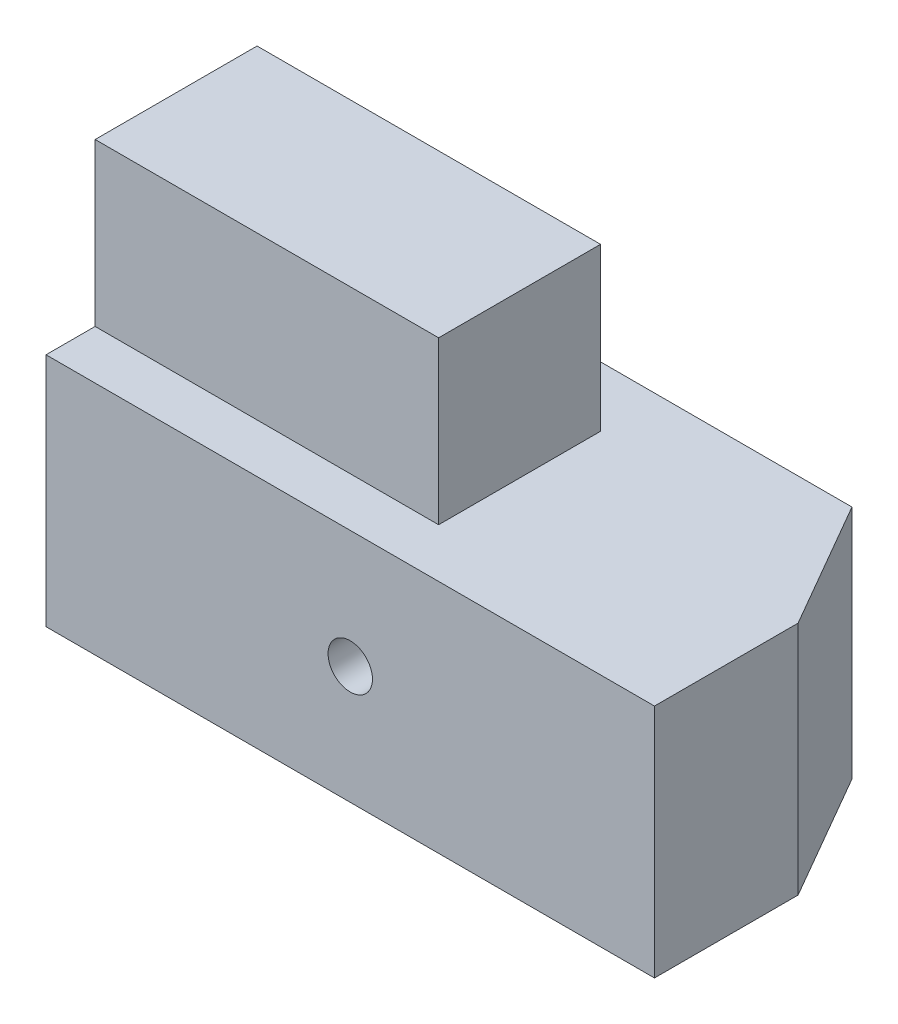
ISO-10303-21;
HEADER;
FILE_DESCRIPTION(('STEP AP214'),'2;1');
FILE_NAME('part.step','',(''),(''),'','','');
FILE_SCHEMA(('AUTOMOTIVE_DESIGN { 1 0 10303 214 1 1 1 1 }'));
ENDSEC;
DATA;
#1=APPLICATION_CONTEXT('core data for automotive mechanical design processes');
#2=APPLICATION_PROTOCOL_DEFINITION('international standard','automotive_design',2000,#1);
#3=PRODUCT_CONTEXT('',#1,'mechanical');
#4=PRODUCT('Part','Part','',(#3));
#5=PRODUCT_RELATED_PRODUCT_CATEGORY('part','',(#4));
#6=PRODUCT_DEFINITION_FORMATION('','',#4);
#7=PRODUCT_DEFINITION_CONTEXT('part definition',#1,'design');
#8=PRODUCT_DEFINITION('design','',#6,#7);
#9=PRODUCT_DEFINITION_SHAPE('','',#8);
#10=(LENGTH_UNIT() NAMED_UNIT(*) SI_UNIT(.MILLI.,.METRE.));
#11=(NAMED_UNIT(*) PLANE_ANGLE_UNIT() SI_UNIT($,.RADIAN.));
#12=(NAMED_UNIT(*) SI_UNIT($,.STERADIAN.) SOLID_ANGLE_UNIT());
#13=UNCERTAINTY_MEASURE_WITH_UNIT(LENGTH_MEASURE(1.E-05),#10,'distance_accuracy_value','');
#14=(GEOMETRIC_REPRESENTATION_CONTEXT(3) GLOBAL_UNCERTAINTY_ASSIGNED_CONTEXT((#13)) GLOBAL_UNIT_ASSIGNED_CONTEXT((#10,
#11,#12)) REPRESENTATION_CONTEXT('',''));
#15=CARTESIAN_POINT('',(0.,0.,0.));
#16=DIRECTION('',(0.,0.,1.));
#17=DIRECTION('',(1.,0.,0.));
#18=AXIS2_PLACEMENT_3D('',#15,#16,#17);
#19=CARTESIAN_POINT('',(-62.,24.,-55.25));
#20=DIRECTION('',(0.,1.,0.));
#21=DIRECTION('',(0.,0.,1.));
#22=AXIS2_PLACEMENT_3D('',#19,#20,#21);
#23=PLANE('',#22);
#24=DIRECTION('',(0.,0.,1.));
#25=VECTOR('',#24,1.);
#26=CARTESIAN_POINT('',(62.,24.,-55.25));
#27=LINE('',#26,#25);
#28=CARTESIAN_POINT('',(62.,24.,-29.2692378864669));
#29=VERTEX_POINT('',#28);
#30=CARTESIAN_POINT('',(62.,24.,0.));
#31=VERTEX_POINT('',#30);
#32=EDGE_CURVE('E164',#29,#31,#27,.T.);
#33=ORIENTED_EDGE('',*,*,#32,.F.);
#34=DIRECTION('',(-0.500000000000002,0.,-0.866025403784438));
#35=VECTOR('',#34,1.);
#36=CARTESIAN_POINT('',(19.7499999999998,24.,-102.448384506252));
#37=LINE('',#36,#35);
#38=CARTESIAN_POINT('',(47.,24.,-55.25));
#39=VERTEX_POINT('',#38);
#40=EDGE_CURVE('E57',#29,#39,#37,.T.);
#41=ORIENTED_EDGE('',*,*,#40,.T.);
#42=DIRECTION('',(-1.,0.,0.));
#43=VECTOR('',#42,1.);
#44=CARTESIAN_POINT('',(-62.,24.,-55.25));
#45=LINE('',#44,#43);
#46=CARTESIAN_POINT('',(-62.,24.,-55.25));
#47=VERTEX_POINT('',#46);
#48=EDGE_CURVE('E148',#39,#47,#45,.T.);
#49=ORIENTED_EDGE('',*,*,#48,.T.);
#50=DIRECTION('',(0.,0.,1.));
#51=VECTOR('',#50,1.);
#52=CARTESIAN_POINT('',(-62.,24.,-55.25));
#53=LINE('',#52,#51);
#54=CARTESIAN_POINT('',(-62.,24.,0.));
#55=VERTEX_POINT('',#54);
#56=EDGE_CURVE('E161',#47,#55,#53,.T.);
#57=ORIENTED_EDGE('',*,*,#56,.T.);
#58=DIRECTION('',(-1.,0.,0.));
#59=VECTOR('',#58,1.);
#60=CARTESIAN_POINT('',(-62.,24.,0.));
#61=LINE('',#60,#59);
#62=EDGE_CURVE('E146',#31,#55,#61,.T.);
#63=ORIENTED_EDGE('',*,*,#62,.F.);
#64=EDGE_LOOP('',(#33,#41,#49,#57,#63));
#65=FACE_BOUND('',#64,.T.);
#66=DIRECTION('',(1.,0.,0.));
#67=VECTOR('',#66,1.);
#68=CARTESIAN_POINT('',(-61.99,24.,-10.));
#69=LINE('',#68,#67);
#70=CARTESIAN_POINT('',(-61.99,24.,-10.));
#71=VERTEX_POINT('',#70);
#72=CARTESIAN_POINT('',(8.01000000000002,24.,-10.));
#73=VERTEX_POINT('',#72);
#74=EDGE_CURVE('E240',#71,#73,#69,.T.);
#75=ORIENTED_EDGE('',*,*,#74,.F.);
#76=DIRECTION('',(0.,0.,1.));
#77=VECTOR('',#76,1.);
#78=CARTESIAN_POINT('',(-61.99,24.,-43.));
#79=LINE('',#78,#77);
#80=CARTESIAN_POINT('',(-61.99,24.,-43.));
#81=VERTEX_POINT('',#80);
#82=EDGE_CURVE('E128',#81,#71,#79,.T.);
#83=ORIENTED_EDGE('',*,*,#82,.F.);
#84=DIRECTION('',(-1.,0.,0.));
#85=VECTOR('',#84,1.);
#86=CARTESIAN_POINT('',(-61.99,24.,-43.));
#87=LINE('',#86,#85);
#88=CARTESIAN_POINT('',(8.01000000000001,24.,-43.));
#89=VERTEX_POINT('',#88);
#90=EDGE_CURVE('E124',#89,#81,#87,.T.);
#91=ORIENTED_EDGE('',*,*,#90,.F.);
#92=DIRECTION('',(0.,0.,-1.));
#93=VECTOR('',#92,1.);
#94=CARTESIAN_POINT('',(8.01000000000002,24.,-43.));
#95=LINE('',#94,#93);
#96=EDGE_CURVE('E237',#73,#89,#95,.T.);
#97=ORIENTED_EDGE('',*,*,#96,.F.);
#98=EDGE_LOOP('',(#75,#83,#91,#97));
#99=FACE_BOUND('',#98,.T.);
#100=ADVANCED_FACE('F35',(#65,#99),#23,.T.);
#101=CARTESIAN_POINT('',(-62.,24.,-55.25));
#102=DIRECTION('',(-1.,0.,0.));
#103=DIRECTION('',(0.,0.,1.));
#104=AXIS2_PLACEMENT_3D('',#101,#102,#103);
#105=PLANE('',#104);
#106=DIRECTION('',(0.,-1.,0.));
#107=VECTOR('',#106,1.);
#108=CARTESIAN_POINT('',(-62.,24.,0.));
#109=LINE('',#108,#107);
#110=CARTESIAN_POINT('',(-62.,-24.,0.));
#111=VERTEX_POINT('',#110);
#112=EDGE_CURVE('E140',#55,#111,#109,.T.);
#113=ORIENTED_EDGE('',*,*,#112,.F.);
#114=ORIENTED_EDGE('',*,*,#56,.F.);
#115=DIRECTION('',(0.,-1.,0.));
#116=VECTOR('',#115,1.);
#117=CARTESIAN_POINT('',(-62.,24.,-55.25));
#118=LINE('',#117,#116);
#119=CARTESIAN_POINT('',(-62.,-24.,-55.25));
#120=VERTEX_POINT('',#119);
#121=EDGE_CURVE('E142',#47,#120,#118,.T.);
#122=ORIENTED_EDGE('',*,*,#121,.T.);
#123=DIRECTION('',(0.,0.,1.));
#124=VECTOR('',#123,1.);
#125=CARTESIAN_POINT('',(-62.,-24.,-55.25));
#126=LINE('',#125,#124);
#127=EDGE_CURVE('E150',#120,#111,#126,.T.);
#128=ORIENTED_EDGE('',*,*,#127,.T.);
#129=EDGE_LOOP('',(#113,#114,#122,#128));
#130=FACE_BOUND('',#129,.T.);
#131=ADVANCED_FACE('F194',(#130),#105,.T.);
#132=CARTESIAN_POINT('',(62.,24.,-55.25));
#133=DIRECTION('',(1.,0.,0.));
#134=DIRECTION('',(0.,0.,-1.));
#135=AXIS2_PLACEMENT_3D('',#132,#133,#134);
#136=PLANE('',#135);
#137=DIRECTION('',(0.,0.,1.));
#138=VECTOR('',#137,1.);
#139=CARTESIAN_POINT('',(62.,-24.,-55.25));
#140=LINE('',#139,#138);
#141=CARTESIAN_POINT('',(62.,-24.,-29.2692378864669));
#142=VERTEX_POINT('',#141);
#143=CARTESIAN_POINT('',(62.,-24.,0.));
#144=VERTEX_POINT('',#143);
#145=EDGE_CURVE('E166',#142,#144,#140,.T.);
#146=ORIENTED_EDGE('',*,*,#145,.F.);
#147=DIRECTION('',(0.,1.,0.));
#148=VECTOR('',#147,1.);
#149=CARTESIAN_POINT('',(62.,24.,-29.2692378864669));
#150=LINE('',#149,#148);
#151=EDGE_CURVE('E163',#142,#29,#150,.T.);
#152=ORIENTED_EDGE('',*,*,#151,.T.);
#153=ORIENTED_EDGE('',*,*,#32,.T.);
#154=DIRECTION('',(0.,1.,0.));
#155=VECTOR('',#154,1.);
#156=CARTESIAN_POINT('',(62.,24.,0.));
#157=LINE('',#156,#155);
#158=EDGE_CURVE('E156',#144,#31,#157,.T.);
#159=ORIENTED_EDGE('',*,*,#158,.F.);
#160=EDGE_LOOP('',(#146,#152,#153,#159));
#161=FACE_BOUND('',#160,.T.);
#162=ADVANCED_FACE('F174',(#161),#136,.T.);
#163=CARTESIAN_POINT('',(-62.,-24.,-55.25));
#164=DIRECTION('',(0.,-1.,0.));
#165=DIRECTION('',(0.,0.,-1.));
#166=AXIS2_PLACEMENT_3D('',#163,#164,#165);
#167=PLANE('',#166);
#168=DIRECTION('',(1.,0.,0.));
#169=VECTOR('',#168,1.);
#170=CARTESIAN_POINT('',(-62.,-24.,-55.25));
#171=LINE('',#170,#169);
#172=CARTESIAN_POINT('',(47.,-24.,-55.25));
#173=VERTEX_POINT('',#172);
#174=EDGE_CURVE('E145',#120,#173,#171,.T.);
#175=ORIENTED_EDGE('',*,*,#174,.T.);
#176=DIRECTION('',(0.500000000000002,0.,0.866025403784438));
#177=VECTOR('',#176,1.);
#178=CARTESIAN_POINT('',(19.7499999999998,-24.,-102.448384506252));
#179=LINE('',#178,#177);
#180=EDGE_CURVE('E11',#173,#142,#179,.T.);
#181=ORIENTED_EDGE('',*,*,#180,.T.);
#182=ORIENTED_EDGE('',*,*,#145,.T.);
#183=DIRECTION('',(1.,0.,0.));
#184=VECTOR('',#183,1.);
#185=CARTESIAN_POINT('',(-62.,-24.,0.));
#186=LINE('',#185,#184);
#187=EDGE_CURVE('E153',#111,#144,#186,.T.);
#188=ORIENTED_EDGE('',*,*,#187,.F.);
#189=ORIENTED_EDGE('',*,*,#127,.F.);
#190=EDGE_LOOP('',(#175,#181,#182,#188,#189));
#191=FACE_BOUND('',#190,.T.);
#192=ADVANCED_FACE('F186',(#191),#167,.T.);
#193=CARTESIAN_POINT('',(0.,0.,-55.25));
#194=DIRECTION('',(0.,0.,1.));
#195=DIRECTION('',(1.,0.,0.));
#196=AXIS2_PLACEMENT_3D('',#193,#194,#195);
#197=PLANE('',#196);
#198=CARTESIAN_POINT('',(0.,0.,-55.25));
#199=DIRECTION('',(0.,0.,1.));
#200=DIRECTION('',(1.,0.,0.));
#201=AXIS2_PLACEMENT_3D('',#198,#199,#200);
#202=CIRCLE('',#201,4.525);
#203=CARTESIAN_POINT('',(4.525,0.,-55.25));
#204=VERTEX_POINT('',#203);
#205=EDGE_CURVE('E133',#204,#204,#202,.T.);
#206=ORIENTED_EDGE('',*,*,#205,.T.);
#207=EDGE_LOOP('',(#206));
#208=FACE_BOUND('',#207,.T.);
#209=ORIENTED_EDGE('',*,*,#48,.F.);
#210=DIRECTION('',(0.,-1.,0.));
#211=VECTOR('',#210,1.);
#212=CARTESIAN_POINT('',(47.,-24.,-55.25));
#213=LINE('',#212,#211);
#214=EDGE_CURVE('E43',#39,#173,#213,.T.);
#215=ORIENTED_EDGE('',*,*,#214,.T.);
#216=ORIENTED_EDGE('',*,*,#174,.F.);
#217=ORIENTED_EDGE('',*,*,#121,.F.);
#218=EDGE_LOOP('',(#209,#215,#216,#217));
#219=FACE_BOUND('',#218,.T.);
#220=ADVANCED_FACE('F206',(#208,#219),#197,.F.);
#221=CARTESIAN_POINT('',(0.,0.,0.));
#222=DIRECTION('',(0.,0.,1.));
#223=DIRECTION('',(1.,0.,0.));
#224=AXIS2_PLACEMENT_3D('',#221,#222,#223);
#225=PLANE('',#224);
#226=CARTESIAN_POINT('',(0.,0.,0.));
#227=DIRECTION('',(0.,0.,1.));
#228=DIRECTION('',(1.,0.,0.));
#229=AXIS2_PLACEMENT_3D('',#226,#227,#228);
#230=CIRCLE('',#229,4.525);
#231=CARTESIAN_POINT('',(4.525,0.,0.));
#232=VERTEX_POINT('',#231);
#233=EDGE_CURVE('E130',#232,#232,#230,.T.);
#234=ORIENTED_EDGE('',*,*,#233,.F.);
#235=EDGE_LOOP('',(#234));
#236=FACE_BOUND('',#235,.T.);
#237=ORIENTED_EDGE('',*,*,#112,.T.);
#238=ORIENTED_EDGE('',*,*,#187,.T.);
#239=ORIENTED_EDGE('',*,*,#158,.T.);
#240=ORIENTED_EDGE('',*,*,#62,.T.);
#241=EDGE_LOOP('',(#237,#238,#239,#240));
#242=FACE_BOUND('',#241,.T.);
#243=ADVANCED_FACE('F183',(#236,#242),#225,.T.);
#244=CARTESIAN_POINT('',(0.,0.,-55.25));
#245=DIRECTION('',(0.,0.,1.));
#246=DIRECTION('',(1.,0.,0.));
#247=AXIS2_PLACEMENT_3D('',#244,#245,#246);
#248=CYLINDRICAL_SURFACE('',#247,4.525);
#249=ORIENTED_EDGE('',*,*,#205,.F.);
#250=EDGE_LOOP('',(#249));
#251=FACE_BOUND('',#250,.T.);
#252=ORIENTED_EDGE('',*,*,#233,.T.);
#253=EDGE_LOOP('',(#252));
#254=FACE_BOUND('',#253,.T.);
#255=ADVANCED_FACE('F214',(#251,#254),#248,.F.);
#256=CARTESIAN_POINT('',(-61.99,57.,-43.));
#257=DIRECTION('',(1.,0.,0.));
#258=DIRECTION('',(0.,0.,-1.));
#259=AXIS2_PLACEMENT_3D('',#256,#257,#258);
#260=PLANE('',#259);
#261=ORIENTED_EDGE('',*,*,#82,.T.);
#262=DIRECTION('',(0.,-1.,0.));
#263=VECTOR('',#262,1.);
#264=CARTESIAN_POINT('',(-61.99,57.,-10.));
#265=LINE('',#264,#263);
#266=CARTESIAN_POINT('',(-61.99,57.,-10.));
#267=VERTEX_POINT('',#266);
#268=EDGE_CURVE('E108',#267,#71,#265,.T.);
#269=ORIENTED_EDGE('',*,*,#268,.F.);
#270=DIRECTION('',(0.,0.,1.));
#271=VECTOR('',#270,1.);
#272=CARTESIAN_POINT('',(-61.99,57.,-43.));
#273=LINE('',#272,#271);
#274=CARTESIAN_POINT('',(-61.99,57.,-43.));
#275=VERTEX_POINT('',#274);
#276=EDGE_CURVE('E115',#275,#267,#273,.T.);
#277=ORIENTED_EDGE('',*,*,#276,.F.);
#278=DIRECTION('',(0.,-1.,0.));
#279=VECTOR('',#278,1.);
#280=CARTESIAN_POINT('',(-61.99,57.,-43.));
#281=LINE('',#280,#279);
#282=EDGE_CURVE('E233',#275,#81,#281,.T.);
#283=ORIENTED_EDGE('',*,*,#282,.T.);
#284=EDGE_LOOP('',(#261,#269,#277,#283));
#285=FACE_BOUND('',#284,.T.);
#286=ADVANCED_FACE('F126',(#285),#260,.F.);
#287=CARTESIAN_POINT('',(-61.99,57.,-10.));
#288=DIRECTION('',(0.,0.,-1.));
#289=DIRECTION('',(-1.,0.,0.));
#290=AXIS2_PLACEMENT_3D('',#287,#288,#289);
#291=PLANE('',#290);
#292=ORIENTED_EDGE('',*,*,#74,.T.);
#293=DIRECTION('',(0.,-1.,0.));
#294=VECTOR('',#293,1.);
#295=CARTESIAN_POINT('',(8.01000000000002,57.,-10.));
#296=LINE('',#295,#294);
#297=CARTESIAN_POINT('',(8.01000000000002,57.,-10.));
#298=VERTEX_POINT('',#297);
#299=EDGE_CURVE('E111',#298,#73,#296,.T.);
#300=ORIENTED_EDGE('',*,*,#299,.F.);
#301=DIRECTION('',(1.,0.,0.));
#302=VECTOR('',#301,1.);
#303=CARTESIAN_POINT('',(-61.99,57.,-10.));
#304=LINE('',#303,#302);
#305=EDGE_CURVE('E104',#267,#298,#304,.T.);
#306=ORIENTED_EDGE('',*,*,#305,.F.);
#307=ORIENTED_EDGE('',*,*,#268,.T.);
#308=EDGE_LOOP('',(#292,#300,#306,#307));
#309=FACE_BOUND('',#308,.T.);
#310=ADVANCED_FACE('F106',(#309),#291,.F.);
#311=CARTESIAN_POINT('',(8.01000000000002,57.,-43.));
#312=DIRECTION('',(-1.,0.,0.));
#313=DIRECTION('',(0.,0.,1.));
#314=AXIS2_PLACEMENT_3D('',#311,#312,#313);
#315=PLANE('',#314);
#316=ORIENTED_EDGE('',*,*,#96,.T.);
#317=DIRECTION('',(0.,-1.,0.));
#318=VECTOR('',#317,1.);
#319=CARTESIAN_POINT('',(8.01000000000002,57.,-43.));
#320=LINE('',#319,#318);
#321=CARTESIAN_POINT('',(8.01000000000002,57.,-43.));
#322=VERTEX_POINT('',#321);
#323=EDGE_CURVE('E135',#322,#89,#320,.T.);
#324=ORIENTED_EDGE('',*,*,#323,.F.);
#325=DIRECTION('',(0.,0.,-1.));
#326=VECTOR('',#325,1.);
#327=CARTESIAN_POINT('',(8.01000000000002,57.,-43.));
#328=LINE('',#327,#326);
#329=EDGE_CURVE('E114',#298,#322,#328,.T.);
#330=ORIENTED_EDGE('',*,*,#329,.F.);
#331=ORIENTED_EDGE('',*,*,#299,.T.);
#332=EDGE_LOOP('',(#316,#324,#330,#331));
#333=FACE_BOUND('',#332,.T.);
#334=ADVANCED_FACE('F224',(#333),#315,.F.);
#335=CARTESIAN_POINT('',(-61.99,57.,-43.));
#336=DIRECTION('',(0.,0.,1.));
#337=DIRECTION('',(1.,0.,0.));
#338=AXIS2_PLACEMENT_3D('',#335,#336,#337);
#339=PLANE('',#338);
#340=ORIENTED_EDGE('',*,*,#90,.T.);
#341=ORIENTED_EDGE('',*,*,#282,.F.);
#342=DIRECTION('',(-1.,0.,0.));
#343=VECTOR('',#342,1.);
#344=CARTESIAN_POINT('',(-61.99,57.,-43.));
#345=LINE('',#344,#343);
#346=EDGE_CURVE('E120',#322,#275,#345,.T.);
#347=ORIENTED_EDGE('',*,*,#346,.F.);
#348=ORIENTED_EDGE('',*,*,#323,.T.);
#349=EDGE_LOOP('',(#340,#341,#347,#348));
#350=FACE_BOUND('',#349,.T.);
#351=ADVANCED_FACE('F191',(#350),#339,.F.);
#352=CARTESIAN_POINT('',(0.,57.,0.));
#353=DIRECTION('',(0.,1.,0.));
#354=DIRECTION('',(0.,0.,1.));
#355=AXIS2_PLACEMENT_3D('',#352,#353,#354);
#356=PLANE('',#355);
#357=ORIENTED_EDGE('',*,*,#276,.T.);
#358=ORIENTED_EDGE('',*,*,#305,.T.);
#359=ORIENTED_EDGE('',*,*,#329,.T.);
#360=ORIENTED_EDGE('',*,*,#346,.T.);
#361=EDGE_LOOP('',(#357,#358,#359,#360));
#362=FACE_BOUND('',#361,.T.);
#363=ADVANCED_FACE('F118',(#362),#356,.T.);
#364=CARTESIAN_POINT('',(62.,24.,-29.2692378864669));
#365=DIRECTION('',(0.866025403784438,0.,-0.500000000000002));
#366=DIRECTION('',(0.,-1.,0.));
#367=AXIS2_PLACEMENT_3D('',#364,#365,#366);
#368=PLANE('',#367);
#369=ORIENTED_EDGE('',*,*,#180,.F.);
#370=ORIENTED_EDGE('',*,*,#214,.F.);
#371=ORIENTED_EDGE('',*,*,#40,.F.);
#372=ORIENTED_EDGE('',*,*,#151,.F.);
#373=EDGE_LOOP('',(#369,#370,#371,#372));
#374=FACE_BOUND('',#373,.T.);
#375=ADVANCED_FACE('F37',(#374),#368,.T.);
#376=CLOSED_SHELL('',(#100,#131,#162,#192,#220,#243,#255,#286,#310,#334,#351,#363,#375));
#377=MANIFOLD_SOLID_BREP('B2',#376);
#378=ADVANCED_BREP_SHAPE_REPRESENTATION('',(#18,#377),#14);
#379=SHAPE_DEFINITION_REPRESENTATION(#9,#378);
ENDSEC;
END-ISO-10303-21;
